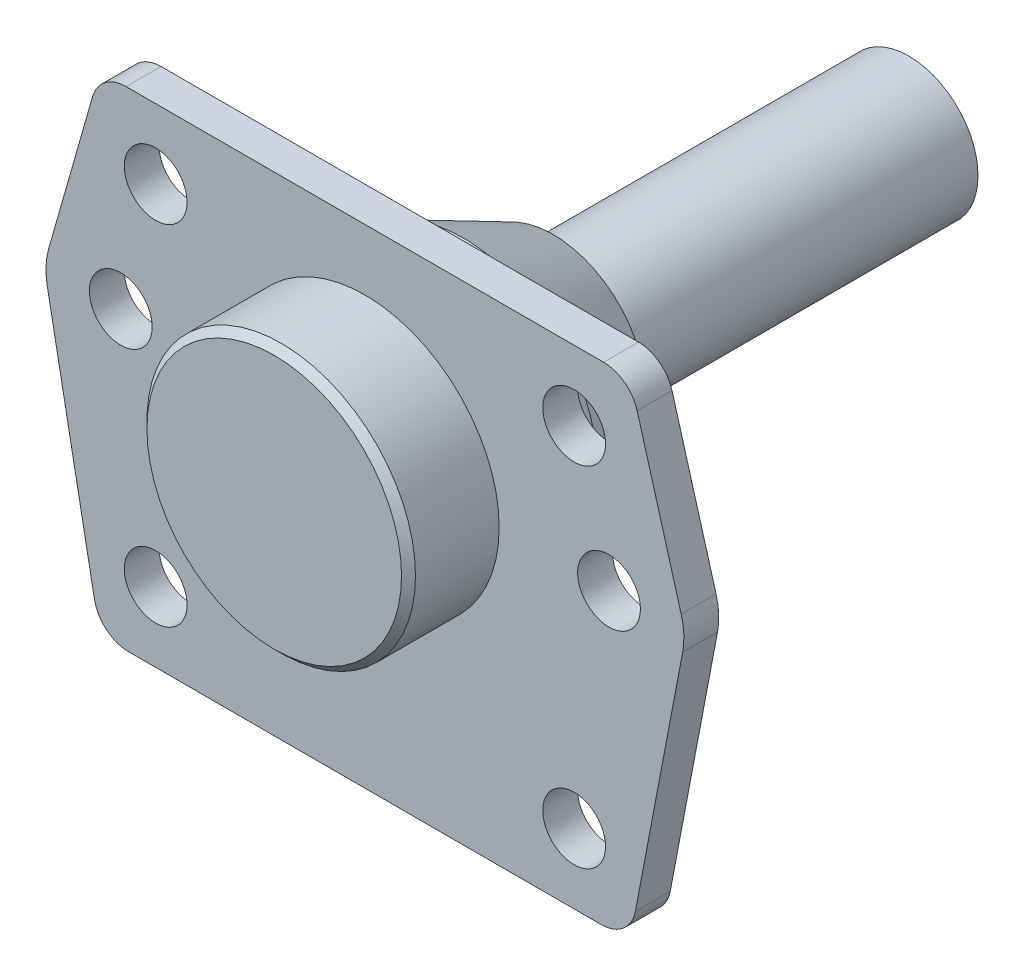
ISO-10303-21;
HEADER;
FILE_DESCRIPTION(('STEP AP214'),'2;1');
FILE_NAME('part.step','',(''),(''),'','','');
FILE_SCHEMA(('AUTOMOTIVE_DESIGN { 1 0 10303 214 1 1 1 1 }'));
ENDSEC;
DATA;
#1=APPLICATION_CONTEXT('core data for automotive mechanical design processes');
#2=APPLICATION_PROTOCOL_DEFINITION('international standard','automotive_design',2000,#1);
#3=PRODUCT_CONTEXT('',#1,'mechanical');
#4=PRODUCT('Part','Part','',(#3));
#5=PRODUCT_RELATED_PRODUCT_CATEGORY('part','',(#4));
#6=PRODUCT_DEFINITION_FORMATION('','',#4);
#7=PRODUCT_DEFINITION_CONTEXT('part definition',#1,'design');
#8=PRODUCT_DEFINITION('design','',#6,#7);
#9=PRODUCT_DEFINITION_SHAPE('','',#8);
#10=(LENGTH_UNIT() NAMED_UNIT(*) SI_UNIT(.MILLI.,.METRE.));
#11=(NAMED_UNIT(*) PLANE_ANGLE_UNIT() SI_UNIT($,.RADIAN.));
#12=(NAMED_UNIT(*) SI_UNIT($,.STERADIAN.) SOLID_ANGLE_UNIT());
#13=UNCERTAINTY_MEASURE_WITH_UNIT(LENGTH_MEASURE(1.E-05),#10,'distance_accuracy_value','');
#14=(GEOMETRIC_REPRESENTATION_CONTEXT(3) GLOBAL_UNCERTAINTY_ASSIGNED_CONTEXT((#13)) GLOBAL_UNIT_ASSIGNED_CONTEXT((#10,
#11,#12)) REPRESENTATION_CONTEXT('',''));
#15=CARTESIAN_POINT('',(0.,0.,0.));
#16=DIRECTION('',(0.,0.,1.));
#17=DIRECTION('',(1.,0.,0.));
#18=AXIS2_PLACEMENT_3D('',#15,#16,#17);
#19=CARTESIAN_POINT('',(0.,0.,-27.));
#20=DIRECTION('',(0.,0.,1.));
#21=DIRECTION('',(1.,0.,0.));
#22=AXIS2_PLACEMENT_3D('',#19,#20,#21);
#23=PLANE('',#22);
#24=CARTESIAN_POINT('',(0.,0.,-27.));
#25=DIRECTION('',(0.,0.,1.));
#26=DIRECTION('',(1.,0.,0.));
#27=AXIS2_PLACEMENT_3D('',#24,#25,#26);
#28=CIRCLE('',#27,13.25);
#29=CARTESIAN_POINT('',(13.25,0.,-27.));
#30=VERTEX_POINT('',#29);
#31=EDGE_CURVE('E11',#30,#30,#28,.F.);
#32=ORIENTED_EDGE('',*,*,#31,.T.);
#33=EDGE_LOOP('',(#32));
#34=FACE_BOUND('',#33,.T.);
#35=CARTESIAN_POINT('',(0.,0.,-27.));
#36=DIRECTION('',(0.,0.,1.));
#37=DIRECTION('',(1.,0.,0.));
#38=AXIS2_PLACEMENT_3D('',#35,#36,#37);
#39=CIRCLE('',#38,9.9);
#40=CARTESIAN_POINT('',(9.9,0.,-27.));
#41=VERTEX_POINT('',#40);
#42=EDGE_CURVE('E239',#41,#41,#39,.F.);
#43=ORIENTED_EDGE('',*,*,#42,.F.);
#44=EDGE_LOOP('',(#43));
#45=FACE_BOUND('',#44,.T.);
#46=ADVANCED_FACE('F38',(#34,#45),#23,.F.);
#47=CARTESIAN_POINT('',(0.,0.,-27.));
#48=DIRECTION('',(0.,0.,1.));
#49=DIRECTION('',(1.,0.,0.));
#50=AXIS2_PLACEMENT_3D('',#47,#48,#49);
#51=CYLINDRICAL_SURFACE('',#50,19.25);
#52=CARTESIAN_POINT('',(0.,0.,-14.1329584769427));
#53=DIRECTION('',(0.,0.,1.));
#54=DIRECTION('',(1.,0.,0.));
#55=AXIS2_PLACEMENT_3D('',#52,#53,#54);
#56=CIRCLE('',#55,19.25);
#57=CARTESIAN_POINT('',(19.25,0.,-14.1329584769427));
#58=VERTEX_POINT('',#57);
#59=EDGE_CURVE('E47',#58,#58,#56,.T.);
#60=ORIENTED_EDGE('',*,*,#59,.T.);
#61=EDGE_LOOP('',(#60));
#62=FACE_BOUND('',#61,.T.);
#63=CARTESIAN_POINT('',(0.,0.,-5.));
#64=DIRECTION('',(0.,0.,1.));
#65=DIRECTION('',(1.,0.,0.));
#66=AXIS2_PLACEMENT_3D('',#63,#64,#65);
#67=CIRCLE('',#66,19.25);
#68=CARTESIAN_POINT('',(19.25,0.,-5.));
#69=VERTEX_POINT('',#68);
#70=EDGE_CURVE('E210',#69,#69,#67,.T.);
#71=ORIENTED_EDGE('',*,*,#70,.F.);
#72=EDGE_LOOP('',(#71));
#73=FACE_BOUND('',#72,.T.);
#74=ADVANCED_FACE('F244',(#62,#73),#51,.T.);
#75=CARTESIAN_POINT('',(44.3894967177243,-8.45514223194749,-5.));
#76=DIRECTION('',(-0.982338566422475,0.187112107889995,0.));
#77=DIRECTION('',(-0.187112107889995,-0.982338566422475,0.));
#78=AXIS2_PLACEMENT_3D('',#75,#76,#77);
#79=PLANE('',#78);
#80=DIRECTION('',(-0.187112107889995,-0.982338566422475,0.));
#81=VECTOR('',#80,1.);
#82=CARTESIAN_POINT('',(44.3894967177243,-8.45514223194749,0.));
#83=LINE('',#82,#81);
#84=CARTESIAN_POINT('',(45.5554490627982,-2.33389242030959,0.));
#85=VERTEX_POINT('',#84);
#86=CARTESIAN_POINT('',(38.7741789448667,-37.93556053945,0.));
#87=VERTEX_POINT('',#86);
#88=EDGE_CURVE('E179',#85,#87,#83,.T.);
#89=ORIENTED_EDGE('',*,*,#88,.T.);
#90=DIRECTION('',(0.,0.,1.));
#91=VECTOR('',#90,1.);
#92=CARTESIAN_POINT('',(38.7741789448667,-37.93556053945,-5.));
#93=LINE('',#92,#91);
#94=CARTESIAN_POINT('',(38.7741789448667,-37.93556053945,-5.));
#95=VERTEX_POINT('',#94);
#96=EDGE_CURVE('E103',#95,#87,#93,.T.);
#97=ORIENTED_EDGE('',*,*,#96,.F.);
#98=DIRECTION('',(-0.187112107889995,-0.982338566422475,0.));
#99=VECTOR('',#98,1.);
#100=CARTESIAN_POINT('',(44.3894967177243,-8.45514223194749,-5.));
#101=LINE('',#100,#99);
#102=CARTESIAN_POINT('',(45.5554490627982,-2.33389242030959,-5.));
#103=VERTEX_POINT('',#102);
#104=EDGE_CURVE('E55',#103,#95,#101,.T.);
#105=ORIENTED_EDGE('',*,*,#104,.F.);
#106=DIRECTION('',(0.,0.,1.));
#107=VECTOR('',#106,1.);
#108=CARTESIAN_POINT('',(45.5554490627982,-2.33389242030959,-5.));
#109=LINE('',#108,#107);
#110=EDGE_CURVE('E111',#103,#85,#109,.T.);
#111=ORIENTED_EDGE('',*,*,#110,.T.);
#112=EDGE_LOOP('',(#89,#97,#105,#111));
#113=FACE_BOUND('',#112,.T.);
#114=ADVANCED_FACE('F263',(#113),#79,.F.);
#115=CARTESIAN_POINT('',(33.8624861127543,-37.,-5.));
#116=DIRECTION('',(0.,0.,1.));
#117=DIRECTION('',(1.,0.,0.));
#118=AXIS2_PLACEMENT_3D('',#115,#116,#117);
#119=CYLINDRICAL_SURFACE('',#118,5.);
#120=CARTESIAN_POINT('',(33.8624861127543,-37.,0.));
#121=DIRECTION('',(0.,0.,1.));
#122=DIRECTION('',(1.,0.,0.));
#123=AXIS2_PLACEMENT_3D('',#120,#121,#122);
#124=CIRCLE('',#123,5.);
#125=CARTESIAN_POINT('',(33.8624861127543,-42.,0.));
#126=VERTEX_POINT('',#125);
#127=EDGE_CURVE('E207',#126,#87,#124,.T.);
#128=ORIENTED_EDGE('',*,*,#127,.F.);
#129=DIRECTION('',(0.,0.,1.));
#130=VECTOR('',#129,1.);
#131=CARTESIAN_POINT('',(33.8624861127543,-42.,-5.));
#132=LINE('',#131,#130);
#133=CARTESIAN_POINT('',(33.8624861127543,-42.,-5.));
#134=VERTEX_POINT('',#133);
#135=EDGE_CURVE('E96',#134,#126,#132,.T.);
#136=ORIENTED_EDGE('',*,*,#135,.F.);
#137=CARTESIAN_POINT('',(33.8624861127543,-37.,-5.));
#138=DIRECTION('',(0.,0.,1.));
#139=DIRECTION('',(1.,0.,0.));
#140=AXIS2_PLACEMENT_3D('',#137,#138,#139);
#141=CIRCLE('',#140,5.);
#142=EDGE_CURVE('E155',#134,#95,#141,.T.);
#143=ORIENTED_EDGE('',*,*,#142,.T.);
#144=ORIENTED_EDGE('',*,*,#96,.T.);
#145=EDGE_LOOP('',(#128,#136,#143,#144));
#146=FACE_BOUND('',#145,.T.);
#147=ADVANCED_FACE('F299',(#146),#119,.T.);
#148=CARTESIAN_POINT('',(0.,-42.,-5.));
#149=DIRECTION('',(0.,-1.,0.));
#150=DIRECTION('',(0.,0.,-1.));
#151=AXIS2_PLACEMENT_3D('',#148,#149,#150);
#152=PLANE('',#151);
#153=DIRECTION('',(1.,0.,0.));
#154=VECTOR('',#153,1.);
#155=CARTESIAN_POINT('',(0.,-42.,0.));
#156=LINE('',#155,#154);
#157=CARTESIAN_POINT('',(-33.8624861127543,-42.,0.));
#158=VERTEX_POINT('',#157);
#159=EDGE_CURVE('E141',#158,#126,#156,.T.);
#160=ORIENTED_EDGE('',*,*,#159,.F.);
#161=DIRECTION('',(0.,0.,1.));
#162=VECTOR('',#161,1.);
#163=CARTESIAN_POINT('',(-33.8624861127543,-42.,-5.));
#164=LINE('',#163,#162);
#165=CARTESIAN_POINT('',(-33.8624861127543,-42.,-5.));
#166=VERTEX_POINT('',#165);
#167=EDGE_CURVE('E136',#166,#158,#164,.T.);
#168=ORIENTED_EDGE('',*,*,#167,.F.);
#169=DIRECTION('',(1.,0.,0.));
#170=VECTOR('',#169,1.);
#171=CARTESIAN_POINT('',(0.,-42.,-5.));
#172=LINE('',#171,#170);
#173=EDGE_CURVE('E140',#166,#134,#172,.T.);
#174=ORIENTED_EDGE('',*,*,#173,.T.);
#175=ORIENTED_EDGE('',*,*,#135,.T.);
#176=EDGE_LOOP('',(#160,#168,#174,#175));
#177=FACE_BOUND('',#176,.T.);
#178=ADVANCED_FACE('F138',(#177),#152,.T.);
#179=CARTESIAN_POINT('',(-33.8624861127543,-37.,-5.));
#180=DIRECTION('',(0.,0.,1.));
#181=DIRECTION('',(1.,0.,0.));
#182=AXIS2_PLACEMENT_3D('',#179,#180,#181);
#183=CYLINDRICAL_SURFACE('',#182,5.);
#184=CARTESIAN_POINT('',(-33.8624861127543,-37.,0.));
#185=DIRECTION('',(0.,0.,1.));
#186=DIRECTION('',(1.,0.,0.));
#187=AXIS2_PLACEMENT_3D('',#184,#185,#186);
#188=CIRCLE('',#187,5.);
#189=CARTESIAN_POINT('',(-38.7741789448667,-37.93556053945,0.));
#190=VERTEX_POINT('',#189);
#191=EDGE_CURVE('E204',#158,#190,#188,.F.);
#192=ORIENTED_EDGE('',*,*,#191,.T.);
#193=DIRECTION('',(0.,0.,1.));
#194=VECTOR('',#193,1.);
#195=CARTESIAN_POINT('',(-38.7741789448667,-37.93556053945,-5.));
#196=LINE('',#195,#194);
#197=CARTESIAN_POINT('',(-38.7741789448667,-37.93556053945,-5.));
#198=VERTEX_POINT('',#197);
#199=EDGE_CURVE('E145',#198,#190,#196,.T.);
#200=ORIENTED_EDGE('',*,*,#199,.F.);
#201=CARTESIAN_POINT('',(-33.8624861127543,-37.,-5.));
#202=DIRECTION('',(0.,0.,1.));
#203=DIRECTION('',(1.,0.,0.));
#204=AXIS2_PLACEMENT_3D('',#201,#202,#203);
#205=CIRCLE('',#204,5.);
#206=EDGE_CURVE('E148',#166,#198,#205,.F.);
#207=ORIENTED_EDGE('',*,*,#206,.F.);
#208=ORIENTED_EDGE('',*,*,#167,.T.);
#209=EDGE_LOOP('',(#192,#200,#207,#208));
#210=FACE_BOUND('',#209,.T.);
#211=ADVANCED_FACE('F149',(#210),#183,.T.);
#212=CARTESIAN_POINT('',(-44.3894967177243,-8.45514223194749,-5.));
#213=DIRECTION('',(-0.982338566422475,-0.187112107889995,0.));
#214=DIRECTION('',(0.187112107889995,-0.982338566422475,0.));
#215=AXIS2_PLACEMENT_3D('',#212,#213,#214);
#216=PLANE('',#215);
#217=DIRECTION('',(0.187112107889995,-0.982338566422475,0.));
#218=VECTOR('',#217,1.);
#219=CARTESIAN_POINT('',(-44.3894967177243,-8.45514223194749,0.));
#220=LINE('',#219,#218);
#221=CARTESIAN_POINT('',(-45.5554490627982,-2.3338924203096,0.));
#222=VERTEX_POINT('',#221);
#223=EDGE_CURVE('E201',#222,#190,#220,.T.);
#224=ORIENTED_EDGE('',*,*,#223,.F.);
#225=DIRECTION('',(0.,0.,1.));
#226=VECTOR('',#225,1.);
#227=CARTESIAN_POINT('',(-45.5554490627982,-2.3338924203096,-5.));
#228=LINE('',#227,#226);
#229=CARTESIAN_POINT('',(-45.5554490627982,-2.3338924203096,-5.));
#230=VERTEX_POINT('',#229);
#231=EDGE_CURVE('E215',#230,#222,#228,.T.);
#232=ORIENTED_EDGE('',*,*,#231,.F.);
#233=DIRECTION('',(0.187112107889995,-0.982338566422475,0.));
#234=VECTOR('',#233,1.);
#235=CARTESIAN_POINT('',(-44.3894967177243,-8.45514223194749,-5.));
#236=LINE('',#235,#234);
#237=EDGE_CURVE('E152',#230,#198,#236,.T.);
#238=ORIENTED_EDGE('',*,*,#237,.T.);
#239=ORIENTED_EDGE('',*,*,#199,.T.);
#240=EDGE_LOOP('',(#224,#232,#238,#239));
#241=FACE_BOUND('',#240,.T.);
#242=ADVANCED_FACE('F306',(#241),#216,.T.);
#243=CARTESIAN_POINT('',(-35.7320633985734,-0.462771341409614,-5.));
#244=DIRECTION('',(0.,0.,1.));
#245=DIRECTION('',(1.,0.,0.));
#246=AXIS2_PLACEMENT_3D('',#243,#244,#245);
#247=CYLINDRICAL_SURFACE('',#246,10.);
#248=CARTESIAN_POINT('',(-35.7320633985734,-0.462771341409614,0.));
#249=DIRECTION('',(0.,0.,1.));
#250=DIRECTION('',(1.,0.,0.));
#251=AXIS2_PLACEMENT_3D('',#248,#249,#250);
#252=CIRCLE('',#251,10.);
#253=CARTESIAN_POINT('',(-45.3473028749816,2.2844399375642,0.));
#254=VERTEX_POINT('',#253);
#255=EDGE_CURVE('E198',#222,#254,#252,.F.);
#256=ORIENTED_EDGE('',*,*,#255,.T.);
#257=DIRECTION('',(0.,0.,1.));
#258=VECTOR('',#257,1.);
#259=CARTESIAN_POINT('',(-45.3473028749816,2.2844399375642,-5.));
#260=LINE('',#259,#258);
#261=CARTESIAN_POINT('',(-45.3473028749816,2.2844399375642,-5.));
#262=VERTEX_POINT('',#261);
#263=EDGE_CURVE('E217',#262,#254,#260,.T.);
#264=ORIENTED_EDGE('',*,*,#263,.F.);
#265=CARTESIAN_POINT('',(-35.7320633985734,-0.462771341409614,-5.));
#266=DIRECTION('',(0.,0.,1.));
#267=DIRECTION('',(1.,0.,0.));
#268=AXIS2_PLACEMENT_3D('',#265,#266,#267);
#269=CIRCLE('',#268,10.);
#270=EDGE_CURVE('E402',#230,#262,#269,.F.);
#271=ORIENTED_EDGE('',*,*,#270,.F.);
#272=ORIENTED_EDGE('',*,*,#231,.T.);
#273=EDGE_LOOP('',(#256,#264,#271,#272));
#274=FACE_BOUND('',#273,.T.);
#275=ADVANCED_FACE('F309',(#274),#247,.T.);
#276=CARTESIAN_POINT('',(-42.5283018867924,12.1509433962264,-5.));
#277=DIRECTION('',(-0.961523947640823,0.274721127897378,0.));
#278=DIRECTION('',(-0.274721127897378,-0.961523947640823,0.));
#279=AXIS2_PLACEMENT_3D('',#276,#277,#278);
#280=PLANE('',#279);
#281=DIRECTION('',(-0.274721127897378,-0.961523947640823,0.));
#282=VECTOR('',#281,1.);
#283=CARTESIAN_POINT('',(-42.5283018867924,12.1509433962264,0.));
#284=LINE('',#283,#282);
#285=CARTESIAN_POINT('',(-39.0361126744323,24.3736056394869,0.));
#286=VERTEX_POINT('',#285);
#287=EDGE_CURVE('E195',#286,#254,#284,.T.);
#288=ORIENTED_EDGE('',*,*,#287,.F.);
#289=DIRECTION('',(0.,0.,1.));
#290=VECTOR('',#289,1.);
#291=CARTESIAN_POINT('',(-39.0361126744323,24.3736056394869,-5.));
#292=LINE('',#291,#290);
#293=CARTESIAN_POINT('',(-39.0361126744323,24.3736056394869,-5.));
#294=VERTEX_POINT('',#293);
#295=EDGE_CURVE('E219',#294,#286,#292,.T.);
#296=ORIENTED_EDGE('',*,*,#295,.F.);
#297=DIRECTION('',(-0.274721127897378,-0.961523947640823,0.));
#298=VECTOR('',#297,1.);
#299=CARTESIAN_POINT('',(-42.5283018867924,12.1509433962264,-5.));
#300=LINE('',#299,#298);
#301=EDGE_CURVE('E399',#294,#262,#300,.T.);
#302=ORIENTED_EDGE('',*,*,#301,.T.);
#303=ORIENTED_EDGE('',*,*,#263,.T.);
#304=EDGE_LOOP('',(#288,#296,#302,#303));
#305=FACE_BOUND('',#304,.T.);
#306=ADVANCED_FACE('F313',(#305),#280,.T.);
#307=CARTESIAN_POINT('',(-34.2284929362282,23.,-5.));
#308=DIRECTION('',(0.,0.,1.));
#309=DIRECTION('',(1.,0.,0.));
#310=AXIS2_PLACEMENT_3D('',#307,#308,#309);
#311=CYLINDRICAL_SURFACE('',#310,5.);
#312=CARTESIAN_POINT('',(-34.2284929362282,23.,0.));
#313=DIRECTION('',(0.,0.,1.));
#314=DIRECTION('',(1.,0.,0.));
#315=AXIS2_PLACEMENT_3D('',#312,#313,#314);
#316=CIRCLE('',#315,5.);
#317=CARTESIAN_POINT('',(-34.2284929362282,28.,0.));
#318=VERTEX_POINT('',#317);
#319=EDGE_CURVE('E193',#286,#318,#316,.F.);
#320=ORIENTED_EDGE('',*,*,#319,.T.);
#321=DIRECTION('',(0.,0.,1.));
#322=VECTOR('',#321,1.);
#323=CARTESIAN_POINT('',(-34.2284929362282,28.,-5.));
#324=LINE('',#323,#322);
#325=CARTESIAN_POINT('',(-34.2284929362282,28.,-5.));
#326=VERTEX_POINT('',#325);
#327=EDGE_CURVE('E221',#326,#318,#324,.T.);
#328=ORIENTED_EDGE('',*,*,#327,.F.);
#329=CARTESIAN_POINT('',(-34.2284929362282,23.,-5.));
#330=DIRECTION('',(0.,0.,1.));
#331=DIRECTION('',(1.,0.,0.));
#332=AXIS2_PLACEMENT_3D('',#329,#330,#331);
#333=CIRCLE('',#332,5.);
#334=EDGE_CURVE('E406',#294,#326,#333,.F.);
#335=ORIENTED_EDGE('',*,*,#334,.F.);
#336=ORIENTED_EDGE('',*,*,#295,.T.);
#337=EDGE_LOOP('',(#320,#328,#335,#336));
#338=FACE_BOUND('',#337,.T.);
#339=ADVANCED_FACE('F317',(#338),#311,.T.);
#340=CARTESIAN_POINT('',(0.,28.,-5.));
#341=DIRECTION('',(0.,-1.,0.));
#342=DIRECTION('',(0.,0.,-1.));
#343=AXIS2_PLACEMENT_3D('',#340,#341,#342);
#344=PLANE('',#343);
#345=DIRECTION('',(1.,0.,0.));
#346=VECTOR('',#345,1.);
#347=CARTESIAN_POINT('',(0.,28.,0.));
#348=LINE('',#347,#346);
#349=CARTESIAN_POINT('',(34.2284929362282,28.,0.));
#350=VERTEX_POINT('',#349);
#351=EDGE_CURVE('E190',#318,#350,#348,.T.);
#352=ORIENTED_EDGE('',*,*,#351,.T.);
#353=DIRECTION('',(0.,0.,1.));
#354=VECTOR('',#353,1.);
#355=CARTESIAN_POINT('',(34.2284929362282,28.,-5.));
#356=LINE('',#355,#354);
#357=CARTESIAN_POINT('',(34.2284929362282,28.,-5.));
#358=VERTEX_POINT('',#357);
#359=EDGE_CURVE('E224',#358,#350,#356,.T.);
#360=ORIENTED_EDGE('',*,*,#359,.F.);
#361=DIRECTION('',(1.,0.,0.));
#362=VECTOR('',#361,1.);
#363=CARTESIAN_POINT('',(0.,28.,-5.));
#364=LINE('',#363,#362);
#365=EDGE_CURVE('E408',#326,#358,#364,.T.);
#366=ORIENTED_EDGE('',*,*,#365,.F.);
#367=ORIENTED_EDGE('',*,*,#327,.T.);
#368=EDGE_LOOP('',(#352,#360,#366,#367));
#369=FACE_BOUND('',#368,.T.);
#370=ADVANCED_FACE('F321',(#369),#344,.F.);
#371=CARTESIAN_POINT('',(34.2284929362282,23.,-5.));
#372=DIRECTION('',(0.,0.,1.));
#373=DIRECTION('',(1.,0.,0.));
#374=AXIS2_PLACEMENT_3D('',#371,#372,#373);
#375=CYLINDRICAL_SURFACE('',#374,5.);
#376=CARTESIAN_POINT('',(34.2284929362282,23.,0.));
#377=DIRECTION('',(0.,0.,1.));
#378=DIRECTION('',(1.,0.,0.));
#379=AXIS2_PLACEMENT_3D('',#376,#377,#378);
#380=CIRCLE('',#379,5.);
#381=CARTESIAN_POINT('',(39.0361126744323,24.3736056394869,0.));
#382=VERTEX_POINT('',#381);
#383=EDGE_CURVE('E187',#382,#350,#380,.T.);
#384=ORIENTED_EDGE('',*,*,#383,.F.);
#385=DIRECTION('',(0.,0.,1.));
#386=VECTOR('',#385,1.);
#387=CARTESIAN_POINT('',(39.0361126744323,24.3736056394869,-5.));
#388=LINE('',#387,#386);
#389=CARTESIAN_POINT('',(39.0361126744323,24.3736056394869,-5.));
#390=VERTEX_POINT('',#389);
#391=EDGE_CURVE('E226',#390,#382,#388,.T.);
#392=ORIENTED_EDGE('',*,*,#391,.F.);
#393=CARTESIAN_POINT('',(34.2284929362282,23.,-5.));
#394=DIRECTION('',(0.,0.,1.));
#395=DIRECTION('',(1.,0.,0.));
#396=AXIS2_PLACEMENT_3D('',#393,#394,#395);
#397=CIRCLE('',#396,5.);
#398=EDGE_CURVE('E389',#390,#358,#397,.T.);
#399=ORIENTED_EDGE('',*,*,#398,.T.);
#400=ORIENTED_EDGE('',*,*,#359,.T.);
#401=EDGE_LOOP('',(#384,#392,#399,#400));
#402=FACE_BOUND('',#401,.T.);
#403=ADVANCED_FACE('F325',(#402),#375,.T.);
#404=CARTESIAN_POINT('',(42.5283018867925,12.1509433962264,-5.));
#405=DIRECTION('',(-0.961523947640823,-0.274721127897378,0.));
#406=DIRECTION('',(0.274721127897378,-0.961523947640823,0.));
#407=AXIS2_PLACEMENT_3D('',#404,#405,#406);
#408=PLANE('',#407);
#409=DIRECTION('',(0.274721127897378,-0.961523947640823,0.));
#410=VECTOR('',#409,1.);
#411=CARTESIAN_POINT('',(42.5283018867925,12.1509433962264,0.));
#412=LINE('',#411,#410);
#413=CARTESIAN_POINT('',(45.3473028749817,2.28443993756421,0.));
#414=VERTEX_POINT('',#413);
#415=EDGE_CURVE('E184',#382,#414,#412,.T.);
#416=ORIENTED_EDGE('',*,*,#415,.T.);
#417=DIRECTION('',(0.,0.,1.));
#418=VECTOR('',#417,1.);
#419=CARTESIAN_POINT('',(45.3473028749817,2.28443993756421,-5.));
#420=LINE('',#419,#418);
#421=CARTESIAN_POINT('',(45.3473028749817,2.28443993756421,-5.));
#422=VERTEX_POINT('',#421);
#423=EDGE_CURVE('E228',#422,#414,#420,.T.);
#424=ORIENTED_EDGE('',*,*,#423,.F.);
#425=DIRECTION('',(0.274721127897378,-0.961523947640823,0.));
#426=VECTOR('',#425,1.);
#427=CARTESIAN_POINT('',(42.5283018867925,12.1509433962264,-5.));
#428=LINE('',#427,#426);
#429=EDGE_CURVE('E411',#390,#422,#428,.T.);
#430=ORIENTED_EDGE('',*,*,#429,.F.);
#431=ORIENTED_EDGE('',*,*,#391,.T.);
#432=EDGE_LOOP('',(#416,#424,#430,#431));
#433=FACE_BOUND('',#432,.T.);
#434=ADVANCED_FACE('F329',(#433),#408,.F.);
#435=CARTESIAN_POINT('',(35.,0.,-5.));
#436=DIRECTION('',(0.,0.,1.));
#437=DIRECTION('',(1.,0.,0.));
#438=AXIS2_PLACEMENT_3D('',#435,#436,#437);
#439=CYLINDRICAL_SURFACE('',#438,4.5);
#440=CARTESIAN_POINT('',(35.,0.,-5.));
#441=DIRECTION('',(0.,0.,1.));
#442=DIRECTION('',(1.,0.,0.));
#443=AXIS2_PLACEMENT_3D('',#440,#441,#442);
#444=CIRCLE('',#443,4.5);
#445=CARTESIAN_POINT('',(39.5,0.,-5.));
#446=VERTEX_POINT('',#445);
#447=EDGE_CURVE('E415',#446,#446,#444,.T.);
#448=ORIENTED_EDGE('',*,*,#447,.F.);
#449=EDGE_LOOP('',(#448));
#450=FACE_BOUND('',#449,.T.);
#451=CARTESIAN_POINT('',(35.,0.,0.));
#452=DIRECTION('',(0.,0.,1.));
#453=DIRECTION('',(1.,0.,0.));
#454=AXIS2_PLACEMENT_3D('',#451,#452,#453);
#455=CIRCLE('',#454,4.5);
#456=CARTESIAN_POINT('',(39.5,0.,0.));
#457=VERTEX_POINT('',#456);
#458=EDGE_CURVE('E176',#457,#457,#455,.T.);
#459=ORIENTED_EDGE('',*,*,#458,.T.);
#460=EDGE_LOOP('',(#459));
#461=FACE_BOUND('',#460,.T.);
#462=ADVANCED_FACE('F333',(#450,#461),#439,.F.);
#463=CARTESIAN_POINT('',(-35.,0.,-5.));
#464=DIRECTION('',(0.,0.,1.));
#465=DIRECTION('',(1.,0.,0.));
#466=AXIS2_PLACEMENT_3D('',#463,#464,#465);
#467=CYLINDRICAL_SURFACE('',#466,4.5);
#468=CARTESIAN_POINT('',(-35.,0.,-5.));
#469=DIRECTION('',(0.,0.,1.));
#470=DIRECTION('',(1.,0.,0.));
#471=AXIS2_PLACEMENT_3D('',#468,#469,#470);
#472=CIRCLE('',#471,4.5);
#473=CARTESIAN_POINT('',(-30.5,0.,-5.));
#474=VERTEX_POINT('',#473);
#475=EDGE_CURVE('E418',#474,#474,#472,.T.);
#476=ORIENTED_EDGE('',*,*,#475,.F.);
#477=EDGE_LOOP('',(#476));
#478=FACE_BOUND('',#477,.T.);
#479=CARTESIAN_POINT('',(-35.,0.,0.));
#480=DIRECTION('',(0.,0.,1.));
#481=DIRECTION('',(1.,0.,0.));
#482=AXIS2_PLACEMENT_3D('',#479,#480,#481);
#483=CIRCLE('',#482,4.5);
#484=CARTESIAN_POINT('',(-30.5,0.,0.));
#485=VERTEX_POINT('',#484);
#486=EDGE_CURVE('E173',#485,#485,#483,.T.);
#487=ORIENTED_EDGE('',*,*,#486,.T.);
#488=EDGE_LOOP('',(#487));
#489=FACE_BOUND('',#488,.T.);
#490=ADVANCED_FACE('F343',(#478,#489),#467,.F.);
#491=CARTESIAN_POINT('',(30.,18.,-5.));
#492=DIRECTION('',(0.,0.,1.));
#493=DIRECTION('',(1.,0.,0.));
#494=AXIS2_PLACEMENT_3D('',#491,#492,#493);
#495=CYLINDRICAL_SURFACE('',#494,4.5);
#496=CARTESIAN_POINT('',(30.,18.,-5.));
#497=DIRECTION('',(0.,0.,1.));
#498=DIRECTION('',(1.,0.,0.));
#499=AXIS2_PLACEMENT_3D('',#496,#497,#498);
#500=CIRCLE('',#499,4.5);
#501=CARTESIAN_POINT('',(34.5,18.,-5.));
#502=VERTEX_POINT('',#501);
#503=EDGE_CURVE('E421',#502,#502,#500,.T.);
#504=ORIENTED_EDGE('',*,*,#503,.F.);
#505=EDGE_LOOP('',(#504));
#506=FACE_BOUND('',#505,.T.);
#507=CARTESIAN_POINT('',(30.,18.,0.));
#508=DIRECTION('',(0.,0.,1.));
#509=DIRECTION('',(1.,0.,0.));
#510=AXIS2_PLACEMENT_3D('',#507,#508,#509);
#511=CIRCLE('',#510,4.5);
#512=CARTESIAN_POINT('',(34.5,18.,0.));
#513=VERTEX_POINT('',#512);
#514=EDGE_CURVE('E170',#513,#513,#511,.T.);
#515=ORIENTED_EDGE('',*,*,#514,.T.);
#516=EDGE_LOOP('',(#515));
#517=FACE_BOUND('',#516,.T.);
#518=ADVANCED_FACE('F347',(#506,#517),#495,.F.);
#519=CARTESIAN_POINT('',(-30.,18.,-5.));
#520=DIRECTION('',(0.,0.,1.));
#521=DIRECTION('',(1.,0.,0.));
#522=AXIS2_PLACEMENT_3D('',#519,#520,#521);
#523=CYLINDRICAL_SURFACE('',#522,4.5);
#524=CARTESIAN_POINT('',(-30.,18.,-5.));
#525=DIRECTION('',(0.,0.,1.));
#526=DIRECTION('',(1.,0.,0.));
#527=AXIS2_PLACEMENT_3D('',#524,#525,#526);
#528=CIRCLE('',#527,4.5);
#529=CARTESIAN_POINT('',(-25.5,18.,-5.));
#530=VERTEX_POINT('',#529);
#531=EDGE_CURVE('E424',#530,#530,#528,.T.);
#532=ORIENTED_EDGE('',*,*,#531,.F.);
#533=EDGE_LOOP('',(#532));
#534=FACE_BOUND('',#533,.T.);
#535=CARTESIAN_POINT('',(-30.,18.,0.));
#536=DIRECTION('',(0.,0.,1.));
#537=DIRECTION('',(1.,0.,0.));
#538=AXIS2_PLACEMENT_3D('',#535,#536,#537);
#539=CIRCLE('',#538,4.5);
#540=CARTESIAN_POINT('',(-25.5,18.,0.));
#541=VERTEX_POINT('',#540);
#542=EDGE_CURVE('E167',#541,#541,#539,.T.);
#543=ORIENTED_EDGE('',*,*,#542,.T.);
#544=EDGE_LOOP('',(#543));
#545=FACE_BOUND('',#544,.T.);
#546=ADVANCED_FACE('F351',(#534,#545),#523,.F.);
#547=CARTESIAN_POINT('',(-30.,-32.,-5.));
#548=DIRECTION('',(0.,0.,1.));
#549=DIRECTION('',(1.,0.,0.));
#550=AXIS2_PLACEMENT_3D('',#547,#548,#549);
#551=CYLINDRICAL_SURFACE('',#550,4.5);
#552=CARTESIAN_POINT('',(-30.,-32.,-5.));
#553=DIRECTION('',(0.,0.,1.));
#554=DIRECTION('',(1.,0.,0.));
#555=AXIS2_PLACEMENT_3D('',#552,#553,#554);
#556=CIRCLE('',#555,4.5);
#557=CARTESIAN_POINT('',(-25.5,-32.,-5.));
#558=VERTEX_POINT('',#557);
#559=EDGE_CURVE('E427',#558,#558,#556,.T.);
#560=ORIENTED_EDGE('',*,*,#559,.F.);
#561=EDGE_LOOP('',(#560));
#562=FACE_BOUND('',#561,.T.);
#563=CARTESIAN_POINT('',(-30.,-32.,0.));
#564=DIRECTION('',(0.,0.,1.));
#565=DIRECTION('',(1.,0.,0.));
#566=AXIS2_PLACEMENT_3D('',#563,#564,#565);
#567=CIRCLE('',#566,4.5);
#568=CARTESIAN_POINT('',(-25.5,-32.,0.));
#569=VERTEX_POINT('',#568);
#570=EDGE_CURVE('E163',#569,#569,#567,.T.);
#571=ORIENTED_EDGE('',*,*,#570,.T.);
#572=EDGE_LOOP('',(#571));
#573=FACE_BOUND('',#572,.T.);
#574=ADVANCED_FACE('F355',(#562,#573),#551,.F.);
#575=CARTESIAN_POINT('',(30.,-32.,-5.));
#576=DIRECTION('',(0.,0.,1.));
#577=DIRECTION('',(1.,0.,0.));
#578=AXIS2_PLACEMENT_3D('',#575,#576,#577);
#579=CYLINDRICAL_SURFACE('',#578,4.5);
#580=CARTESIAN_POINT('',(30.,-32.,-5.));
#581=DIRECTION('',(0.,0.,1.));
#582=DIRECTION('',(1.,0.,0.));
#583=AXIS2_PLACEMENT_3D('',#580,#581,#582);
#584=CIRCLE('',#583,4.5);
#585=CARTESIAN_POINT('',(34.5,-32.,-5.));
#586=VERTEX_POINT('',#585);
#587=EDGE_CURVE('E366',#586,#586,#584,.T.);
#588=ORIENTED_EDGE('',*,*,#587,.F.);
#589=EDGE_LOOP('',(#588));
#590=FACE_BOUND('',#589,.T.);
#591=CARTESIAN_POINT('',(30.,-32.,0.));
#592=DIRECTION('',(0.,0.,1.));
#593=DIRECTION('',(1.,0.,0.));
#594=AXIS2_PLACEMENT_3D('',#591,#592,#593);
#595=CIRCLE('',#594,4.5);
#596=CARTESIAN_POINT('',(34.5,-32.,0.));
#597=VERTEX_POINT('',#596);
#598=EDGE_CURVE('E160',#597,#597,#595,.T.);
#599=ORIENTED_EDGE('',*,*,#598,.T.);
#600=EDGE_LOOP('',(#599));
#601=FACE_BOUND('',#600,.T.);
#602=ADVANCED_FACE('F337',(#590,#601),#579,.F.);
#603=CARTESIAN_POINT('',(35.7320633985734,-0.462771341409608,-5.));
#604=DIRECTION('',(0.,0.,1.));
#605=DIRECTION('',(1.,0.,0.));
#606=AXIS2_PLACEMENT_3D('',#603,#604,#605);
#607=CYLINDRICAL_SURFACE('',#606,10.);
#608=CARTESIAN_POINT('',(35.7320633985734,-0.462771341409608,0.));
#609=DIRECTION('',(0.,0.,1.));
#610=DIRECTION('',(1.,0.,0.));
#611=AXIS2_PLACEMENT_3D('',#608,#609,#610);
#612=CIRCLE('',#611,10.);
#613=EDGE_CURVE('E181',#85,#414,#612,.T.);
#614=ORIENTED_EDGE('',*,*,#613,.F.);
#615=ORIENTED_EDGE('',*,*,#110,.F.);
#616=CARTESIAN_POINT('',(35.7320633985734,-0.462771341409608,-5.));
#617=DIRECTION('',(0.,0.,1.));
#618=DIRECTION('',(1.,0.,0.));
#619=AXIS2_PLACEMENT_3D('',#616,#617,#618);
#620=CIRCLE('',#619,10.);
#621=EDGE_CURVE('E382',#103,#422,#620,.T.);
#622=ORIENTED_EDGE('',*,*,#621,.T.);
#623=ORIENTED_EDGE('',*,*,#423,.T.);
#624=EDGE_LOOP('',(#614,#615,#622,#623));
#625=FACE_BOUND('',#624,.T.);
#626=ADVANCED_FACE('F294',(#625),#607,.T.);
#627=CARTESIAN_POINT('',(0.,0.,-5.));
#628=DIRECTION('',(0.,0.,1.));
#629=DIRECTION('',(1.,0.,0.));
#630=AXIS2_PLACEMENT_3D('',#627,#628,#629);
#631=PLANE('',#630);
#632=ORIENTED_EDGE('',*,*,#70,.T.);
#633=EDGE_LOOP('',(#632));
#634=FACE_BOUND('',#633,.T.);
#635=ORIENTED_EDGE('',*,*,#587,.T.);
#636=EDGE_LOOP('',(#635));
#637=FACE_BOUND('',#636,.T.);
#638=ORIENTED_EDGE('',*,*,#559,.T.);
#639=EDGE_LOOP('',(#638));
#640=FACE_BOUND('',#639,.T.);
#641=ORIENTED_EDGE('',*,*,#531,.T.);
#642=EDGE_LOOP('',(#641));
#643=FACE_BOUND('',#642,.T.);
#644=ORIENTED_EDGE('',*,*,#503,.T.);
#645=EDGE_LOOP('',(#644));
#646=FACE_BOUND('',#645,.T.);
#647=ORIENTED_EDGE('',*,*,#475,.T.);
#648=EDGE_LOOP('',(#647));
#649=FACE_BOUND('',#648,.T.);
#650=ORIENTED_EDGE('',*,*,#447,.T.);
#651=EDGE_LOOP('',(#650));
#652=FACE_BOUND('',#651,.T.);
#653=ORIENTED_EDGE('',*,*,#104,.T.);
#654=ORIENTED_EDGE('',*,*,#142,.F.);
#655=ORIENTED_EDGE('',*,*,#173,.F.);
#656=ORIENTED_EDGE('',*,*,#206,.T.);
#657=ORIENTED_EDGE('',*,*,#237,.F.);
#658=ORIENTED_EDGE('',*,*,#270,.T.);
#659=ORIENTED_EDGE('',*,*,#301,.F.);
#660=ORIENTED_EDGE('',*,*,#334,.T.);
#661=ORIENTED_EDGE('',*,*,#365,.T.);
#662=ORIENTED_EDGE('',*,*,#398,.F.);
#663=ORIENTED_EDGE('',*,*,#429,.T.);
#664=ORIENTED_EDGE('',*,*,#621,.F.);
#665=EDGE_LOOP('',(#653,#654,#655,#656,#657,#658,#659,#660,#661,#662,#663,#664));
#666=FACE_BOUND('',#665,.T.);
#667=ADVANCED_FACE('F154',(#634,#637,#640,#643,#646,#649,#652,#666),#631,.F.);
#668=CARTESIAN_POINT('',(0.,0.,0.));
#669=DIRECTION('',(0.,0.,1.));
#670=DIRECTION('',(1.,0.,0.));
#671=AXIS2_PLACEMENT_3D('',#668,#669,#670);
#672=PLANE('',#671);
#673=CARTESIAN_POINT('',(0.,0.,0.));
#674=DIRECTION('',(0.,0.,1.));
#675=DIRECTION('',(1.,0.,0.));
#676=AXIS2_PLACEMENT_3D('',#673,#674,#675);
#677=CIRCLE('',#676,19.25);
#678=CARTESIAN_POINT('',(19.25,0.,0.));
#679=VERTEX_POINT('',#678);
#680=EDGE_CURVE('E212',#679,#679,#677,.F.);
#681=ORIENTED_EDGE('',*,*,#680,.T.);
#682=EDGE_LOOP('',(#681));
#683=FACE_BOUND('',#682,.T.);
#684=ORIENTED_EDGE('',*,*,#598,.F.);
#685=EDGE_LOOP('',(#684));
#686=FACE_BOUND('',#685,.T.);
#687=ORIENTED_EDGE('',*,*,#570,.F.);
#688=EDGE_LOOP('',(#687));
#689=FACE_BOUND('',#688,.T.);
#690=ORIENTED_EDGE('',*,*,#542,.F.);
#691=EDGE_LOOP('',(#690));
#692=FACE_BOUND('',#691,.T.);
#693=ORIENTED_EDGE('',*,*,#514,.F.);
#694=EDGE_LOOP('',(#693));
#695=FACE_BOUND('',#694,.T.);
#696=ORIENTED_EDGE('',*,*,#486,.F.);
#697=EDGE_LOOP('',(#696));
#698=FACE_BOUND('',#697,.T.);
#699=ORIENTED_EDGE('',*,*,#458,.F.);
#700=EDGE_LOOP('',(#699));
#701=FACE_BOUND('',#700,.T.);
#702=ORIENTED_EDGE('',*,*,#88,.F.);
#703=ORIENTED_EDGE('',*,*,#613,.T.);
#704=ORIENTED_EDGE('',*,*,#415,.F.);
#705=ORIENTED_EDGE('',*,*,#383,.T.);
#706=ORIENTED_EDGE('',*,*,#351,.F.);
#707=ORIENTED_EDGE('',*,*,#319,.F.);
#708=ORIENTED_EDGE('',*,*,#287,.T.);
#709=ORIENTED_EDGE('',*,*,#255,.F.);
#710=ORIENTED_EDGE('',*,*,#223,.T.);
#711=ORIENTED_EDGE('',*,*,#191,.F.);
#712=ORIENTED_EDGE('',*,*,#159,.T.);
#713=ORIENTED_EDGE('',*,*,#127,.T.);
#714=EDGE_LOOP('',(#702,#703,#704,#705,#706,#707,#708,#709,#710,#711,#712,#713));
#715=FACE_BOUND('',#714,.T.);
#716=ADVANCED_FACE('F285',(#683,#686,#689,#692,#695,#698,#701,#715),#672,.T.);
#717=CARTESIAN_POINT('',(0.,0.,13.));
#718=DIRECTION('',(0.,0.,1.));
#719=DIRECTION('',(1.,0.,0.));
#720=AXIS2_PLACEMENT_3D('',#717,#718,#719);
#721=PLANE('',#720);
#722=CARTESIAN_POINT('',(0.,0.,13.));
#723=DIRECTION('',(0.,0.,1.));
#724=DIRECTION('',(1.,0.,0.));
#725=AXIS2_PLACEMENT_3D('',#722,#723,#724);
#726=CIRCLE('',#725,18.25);
#727=CARTESIAN_POINT('',(18.25,0.,13.));
#728=VERTEX_POINT('',#727);
#729=EDGE_CURVE('E233',#728,#728,#726,.T.);
#730=ORIENTED_EDGE('',*,*,#729,.T.);
#731=EDGE_LOOP('',(#730));
#732=FACE_BOUND('',#731,.T.);
#733=ADVANCED_FACE('F268',(#732),#721,.T.);
#734=CARTESIAN_POINT('',(0.,0.,12.));
#735=DIRECTION('',(0.,0.,1.));
#736=DIRECTION('',(1.,0.,0.));
#737=AXIS2_PLACEMENT_3D('',#734,#735,#736);
#738=CIRCLE('',#737,19.25);
#739=CARTESIAN_POINT('',(19.25,0.,12.));
#740=VERTEX_POINT('',#739);
#741=EDGE_CURVE('E236',#740,#740,#738,.F.);
#742=ORIENTED_EDGE('',*,*,#741,.T.);
#743=EDGE_LOOP('',(#742));
#744=FACE_BOUND('',#743,.T.);
#745=ORIENTED_EDGE('',*,*,#680,.F.);
#746=EDGE_LOOP('',(#745));
#747=FACE_BOUND('',#746,.T.);
#748=ADVANCED_FACE('F265',(#744,#747),#51,.T.);
#749=CARTESIAN_POINT('',(0.,0.,13.));
#750=DIRECTION('',(0.,0.,-1.));
#751=DIRECTION('',(-1.,0.,0.));
#752=AXIS2_PLACEMENT_3D('',#749,#750,#751);
#753=CONICAL_SURFACE('',#752,18.25,0.785398163397443);
#754=ORIENTED_EDGE('',*,*,#741,.F.);
#755=EDGE_LOOP('',(#754));
#756=FACE_BOUND('',#755,.T.);
#757=ORIENTED_EDGE('',*,*,#729,.F.);
#758=EDGE_LOOP('',(#757));
#759=FACE_BOUND('',#758,.T.);
#760=ADVANCED_FACE('F271',(#756,#759),#753,.T.);
#761=CARTESIAN_POINT('',(0.,0.,-78.));
#762=DIRECTION('',(0.,0.,1.));
#763=DIRECTION('',(1.,0.,0.));
#764=AXIS2_PLACEMENT_3D('',#761,#762,#763);
#765=CYLINDRICAL_SURFACE('',#764,9.9);
#766=CARTESIAN_POINT('',(0.,0.,-78.));
#767=DIRECTION('',(0.,0.,-1.));
#768=DIRECTION('',(-1.,0.,0.));
#769=AXIS2_PLACEMENT_3D('',#766,#767,#768);
#770=CIRCLE('',#769,9.9);
#771=CARTESIAN_POINT('',(-9.9,0.,-78.));
#772=VERTEX_POINT('',#771);
#773=EDGE_CURVE('E164',#772,#772,#770,.T.);
#774=ORIENTED_EDGE('',*,*,#773,.F.);
#775=EDGE_LOOP('',(#774));
#776=FACE_BOUND('',#775,.T.);
#777=ORIENTED_EDGE('',*,*,#42,.T.);
#778=EDGE_LOOP('',(#777));
#779=FACE_BOUND('',#778,.T.);
#780=ADVANCED_FACE('F253',(#776,#779),#765,.T.);
#781=CARTESIAN_POINT('',(0.,0.,-78.));
#782=DIRECTION('',(0.,0.,-1.));
#783=DIRECTION('',(-1.,0.,0.));
#784=AXIS2_PLACEMENT_3D('',#781,#782,#783);
#785=PLANE('',#784);
#786=ORIENTED_EDGE('',*,*,#773,.T.);
#787=EDGE_LOOP('',(#786));
#788=FACE_BOUND('',#787,.T.);
#789=ADVANCED_FACE('F248',(#788),#785,.T.);
#790=CARTESIAN_POINT('',(0.,0.,-14.1329584769427));
#791=DIRECTION('',(0.,0.,1.));
#792=DIRECTION('',(1.,0.,0.));
#793=AXIS2_PLACEMENT_3D('',#790,#791,#792);
#794=CONICAL_SURFACE('',#793,19.25,0.436332312998584);
#795=ORIENTED_EDGE('',*,*,#31,.F.);
#796=EDGE_LOOP('',(#795));
#797=FACE_BOUND('',#796,.T.);
#798=ORIENTED_EDGE('',*,*,#59,.F.);
#799=EDGE_LOOP('',(#798));
#800=FACE_BOUND('',#799,.T.);
#801=ADVANCED_FACE('F40',(#797,#800),#794,.T.);
#802=CLOSED_SHELL('',(#46,#74,#114,#147,#178,#211,#242,#275,#306,#339,#370,#403,#434,#462,#490,
#518,#546,#574,#602,#626,#667,#716,#733,#748,#760,#780,#789,#801));
#803=MANIFOLD_SOLID_BREP('B2',#802);
#804=ADVANCED_BREP_SHAPE_REPRESENTATION('',(#18,#803),#14);
#805=SHAPE_DEFINITION_REPRESENTATION(#9,#804);
ENDSEC;
END-ISO-10303-21;
